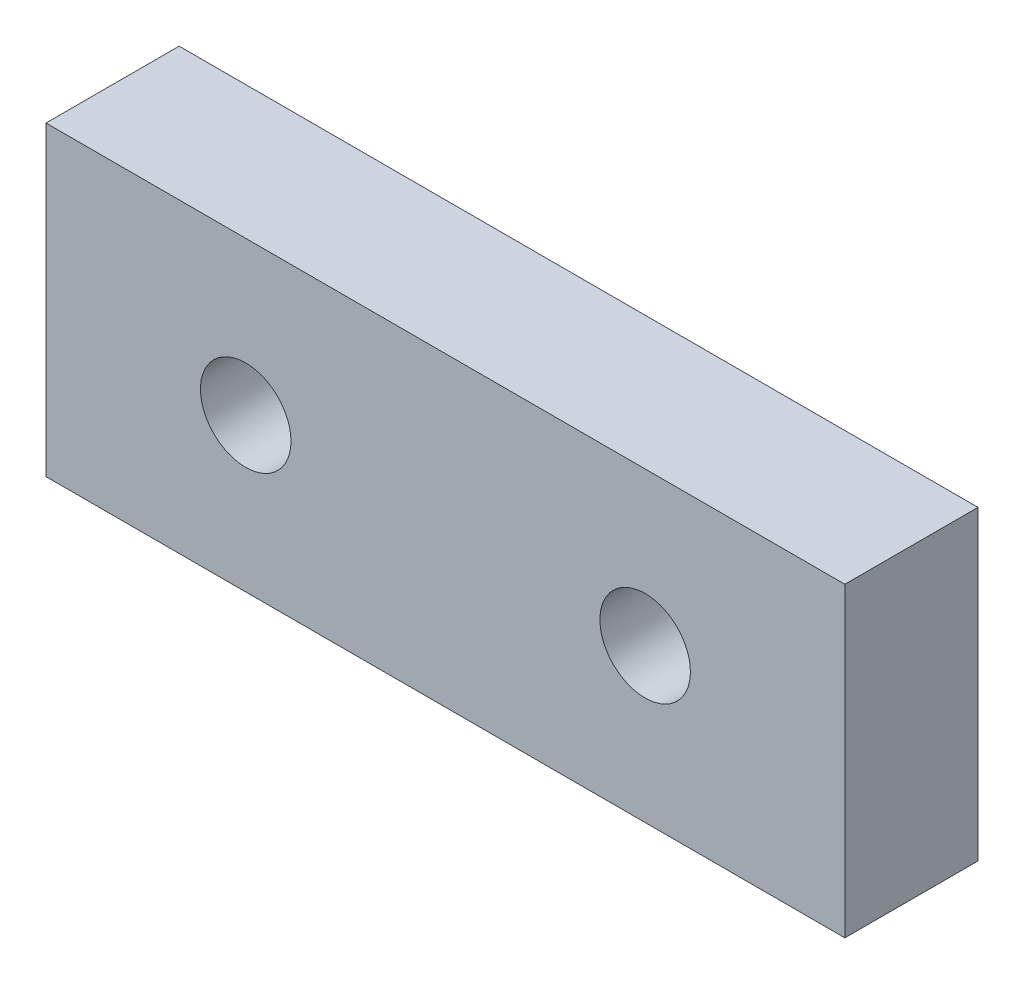
ISO-10303-21;
HEADER;
FILE_DESCRIPTION(('STEP AP214'),'2;1');
FILE_NAME('part.step','',(''),(''),'','','');
FILE_SCHEMA(('AUTOMOTIVE_DESIGN { 1 0 10303 214 1 1 1 1 }'));
ENDSEC;
DATA;
#1=APPLICATION_CONTEXT('core data for automotive mechanical design processes');
#2=APPLICATION_PROTOCOL_DEFINITION('international standard','automotive_design',2000,#1);
#3=PRODUCT_CONTEXT('',#1,'mechanical');
#4=PRODUCT('Part','Part','',(#3));
#5=PRODUCT_RELATED_PRODUCT_CATEGORY('part','',(#4));
#6=PRODUCT_DEFINITION_FORMATION('','',#4);
#7=PRODUCT_DEFINITION_CONTEXT('part definition',#1,'design');
#8=PRODUCT_DEFINITION('design','',#6,#7);
#9=PRODUCT_DEFINITION_SHAPE('','',#8);
#10=(LENGTH_UNIT() NAMED_UNIT(*) SI_UNIT(.MILLI.,.METRE.));
#11=(NAMED_UNIT(*) PLANE_ANGLE_UNIT() SI_UNIT($,.RADIAN.));
#12=(NAMED_UNIT(*) SI_UNIT($,.STERADIAN.) SOLID_ANGLE_UNIT());
#13=UNCERTAINTY_MEASURE_WITH_UNIT(LENGTH_MEASURE(1.E-05),#10,'distance_accuracy_value','');
#14=(GEOMETRIC_REPRESENTATION_CONTEXT(3) GLOBAL_UNCERTAINTY_ASSIGNED_CONTEXT((#13)) GLOBAL_UNIT_ASSIGNED_CONTEXT((#10,
#11,#12)) REPRESENTATION_CONTEXT('',''));
#15=CARTESIAN_POINT('',(0.,0.,0.));
#16=DIRECTION('',(0.,0.,1.));
#17=DIRECTION('',(1.,0.,0.));
#18=AXIS2_PLACEMENT_3D('',#15,#16,#17);
#19=CARTESIAN_POINT('',(15.,5.75,5.));
#20=DIRECTION('',(-1.,0.,0.));
#21=DIRECTION('',(0.,0.,1.));
#22=AXIS2_PLACEMENT_3D('',#19,#20,#21);
#23=PLANE('',#22);
#24=DIRECTION('',(0.,1.,0.));
#25=VECTOR('',#24,1.);
#26=CARTESIAN_POINT('',(15.,5.75,0.));
#27=LINE('',#26,#25);
#28=CARTESIAN_POINT('',(15.,-5.75,0.));
#29=VERTEX_POINT('',#28);
#30=CARTESIAN_POINT('',(15.,5.75,0.));
#31=VERTEX_POINT('',#30);
#32=EDGE_CURVE('E98',#29,#31,#27,.T.);
#33=ORIENTED_EDGE('',*,*,#32,.T.);
#34=DIRECTION('',(0.,0.,-1.));
#35=VECTOR('',#34,1.);
#36=CARTESIAN_POINT('',(15.,5.75,5.));
#37=LINE('',#36,#35);
#38=CARTESIAN_POINT('',(15.,5.75,5.));
#39=VERTEX_POINT('',#38);
#40=EDGE_CURVE('E11',#39,#31,#37,.T.);
#41=ORIENTED_EDGE('',*,*,#40,.F.);
#42=DIRECTION('',(0.,1.,0.));
#43=VECTOR('',#42,1.);
#44=CARTESIAN_POINT('',(15.,5.75,5.));
#45=LINE('',#44,#43);
#46=CARTESIAN_POINT('',(15.,-5.75,5.));
#47=VERTEX_POINT('',#46);
#48=EDGE_CURVE('E86',#47,#39,#45,.T.);
#49=ORIENTED_EDGE('',*,*,#48,.F.);
#50=DIRECTION('',(0.,0.,-1.));
#51=VECTOR('',#50,1.);
#52=CARTESIAN_POINT('',(15.,-5.75,5.));
#53=LINE('',#52,#51);
#54=EDGE_CURVE('E94',#47,#29,#53,.T.);
#55=ORIENTED_EDGE('',*,*,#54,.T.);
#56=EDGE_LOOP('',(#33,#41,#49,#55));
#57=FACE_BOUND('',#56,.T.);
#58=ADVANCED_FACE('F35',(#57),#23,.F.);
#59=CARTESIAN_POINT('',(-15.,5.75,5.));
#60=DIRECTION('',(0.,-1.,0.));
#61=DIRECTION('',(0.,0.,-1.));
#62=AXIS2_PLACEMENT_3D('',#59,#60,#61);
#63=PLANE('',#62);
#64=DIRECTION('',(-1.,0.,0.));
#65=VECTOR('',#64,1.);
#66=CARTESIAN_POINT('',(-15.,5.75,0.));
#67=LINE('',#66,#65);
#68=CARTESIAN_POINT('',(-15.,5.75,0.));
#69=VERTEX_POINT('',#68);
#70=EDGE_CURVE('E90',#31,#69,#67,.T.);
#71=ORIENTED_EDGE('',*,*,#70,.T.);
#72=DIRECTION('',(0.,0.,-1.));
#73=VECTOR('',#72,1.);
#74=CARTESIAN_POINT('',(-15.,5.75,5.));
#75=LINE('',#74,#73);
#76=CARTESIAN_POINT('',(-15.,5.75,5.));
#77=VERTEX_POINT('',#76);
#78=EDGE_CURVE('E43',#77,#69,#75,.T.);
#79=ORIENTED_EDGE('',*,*,#78,.F.);
#80=DIRECTION('',(-1.,0.,0.));
#81=VECTOR('',#80,1.);
#82=CARTESIAN_POINT('',(-15.,5.75,5.));
#83=LINE('',#82,#81);
#84=EDGE_CURVE('E81',#39,#77,#83,.T.);
#85=ORIENTED_EDGE('',*,*,#84,.F.);
#86=ORIENTED_EDGE('',*,*,#40,.T.);
#87=EDGE_LOOP('',(#71,#79,#85,#86));
#88=FACE_BOUND('',#87,.T.);
#89=ADVANCED_FACE('F89',(#88),#63,.F.);
#90=CARTESIAN_POINT('',(-15.,5.75,5.));
#91=DIRECTION('',(1.,0.,0.));
#92=DIRECTION('',(0.,1.,0.));
#93=AXIS2_PLACEMENT_3D('',#90,#91,#92);
#94=PLANE('',#93);
#95=DIRECTION('',(0.,-1.,0.));
#96=VECTOR('',#95,1.);
#97=CARTESIAN_POINT('',(-15.,5.75,0.));
#98=LINE('',#97,#96);
#99=CARTESIAN_POINT('',(-15.,-5.75,0.));
#100=VERTEX_POINT('',#99);
#101=EDGE_CURVE('E68',#69,#100,#98,.T.);
#102=ORIENTED_EDGE('',*,*,#101,.T.);
#103=DIRECTION('',(0.,0.,-1.));
#104=VECTOR('',#103,1.);
#105=CARTESIAN_POINT('',(-15.,-5.75,5.));
#106=LINE('',#105,#104);
#107=CARTESIAN_POINT('',(-15.,-5.75,5.));
#108=VERTEX_POINT('',#107);
#109=EDGE_CURVE('E91',#108,#100,#106,.T.);
#110=ORIENTED_EDGE('',*,*,#109,.F.);
#111=DIRECTION('',(0.,-1.,0.));
#112=VECTOR('',#111,1.);
#113=CARTESIAN_POINT('',(-15.,5.75,5.));
#114=LINE('',#113,#112);
#115=EDGE_CURVE('E84',#77,#108,#114,.T.);
#116=ORIENTED_EDGE('',*,*,#115,.F.);
#117=ORIENTED_EDGE('',*,*,#78,.T.);
#118=EDGE_LOOP('',(#102,#110,#116,#117));
#119=FACE_BOUND('',#118,.T.);
#120=ADVANCED_FACE('F92',(#119),#94,.F.);
#121=CARTESIAN_POINT('',(-15.,-5.75,5.));
#122=DIRECTION('',(0.,1.,0.));
#123=DIRECTION('',(0.,0.,1.));
#124=AXIS2_PLACEMENT_3D('',#121,#122,#123);
#125=PLANE('',#124);
#126=DIRECTION('',(1.,0.,0.));
#127=VECTOR('',#126,1.);
#128=CARTESIAN_POINT('',(-15.,-5.75,0.));
#129=LINE('',#128,#127);
#130=EDGE_CURVE('E74',#100,#29,#129,.T.);
#131=ORIENTED_EDGE('',*,*,#130,.T.);
#132=ORIENTED_EDGE('',*,*,#54,.F.);
#133=DIRECTION('',(1.,0.,0.));
#134=VECTOR('',#133,1.);
#135=CARTESIAN_POINT('',(-15.,-5.75,5.));
#136=LINE('',#135,#134);
#137=EDGE_CURVE('E51',#108,#47,#136,.T.);
#138=ORIENTED_EDGE('',*,*,#137,.F.);
#139=ORIENTED_EDGE('',*,*,#109,.T.);
#140=EDGE_LOOP('',(#131,#132,#138,#139));
#141=FACE_BOUND('',#140,.T.);
#142=ADVANCED_FACE('F106',(#141),#125,.F.);
#143=CARTESIAN_POINT('',(0.,0.,5.));
#144=DIRECTION('',(0.,0.,1.));
#145=DIRECTION('',(1.,0.,0.));
#146=AXIS2_PLACEMENT_3D('',#143,#144,#145);
#147=PLANE('',#146);
#148=CARTESIAN_POINT('',(7.5,0.,5.));
#149=DIRECTION('',(0.,0.,1.));
#150=DIRECTION('',(1.,0.,0.));
#151=AXIS2_PLACEMENT_3D('',#148,#149,#150);
#152=CIRCLE('',#151,1.7);
#153=CARTESIAN_POINT('',(9.2,0.,5.));
#154=VERTEX_POINT('',#153);
#155=EDGE_CURVE('E120',#154,#154,#152,.T.);
#156=ORIENTED_EDGE('',*,*,#155,.F.);
#157=EDGE_LOOP('',(#156));
#158=FACE_BOUND('',#157,.T.);
#159=CARTESIAN_POINT('',(-7.5,0.,5.));
#160=DIRECTION('',(0.,0.,1.));
#161=DIRECTION('',(1.,0.,0.));
#162=AXIS2_PLACEMENT_3D('',#159,#160,#161);
#163=CIRCLE('',#162,1.7);
#164=CARTESIAN_POINT('',(-5.8,0.,5.));
#165=VERTEX_POINT('',#164);
#166=EDGE_CURVE('E114',#165,#165,#163,.T.);
#167=ORIENTED_EDGE('',*,*,#166,.F.);
#168=EDGE_LOOP('',(#167));
#169=FACE_BOUND('',#168,.T.);
#170=ORIENTED_EDGE('',*,*,#48,.T.);
#171=ORIENTED_EDGE('',*,*,#84,.T.);
#172=ORIENTED_EDGE('',*,*,#115,.T.);
#173=ORIENTED_EDGE('',*,*,#137,.T.);
#174=EDGE_LOOP('',(#170,#171,#172,#173));
#175=FACE_BOUND('',#174,.T.);
#176=ADVANCED_FACE('F82',(#158,#169,#175),#147,.T.);
#177=CARTESIAN_POINT('',(0.,0.,0.));
#178=DIRECTION('',(0.,0.,1.));
#179=DIRECTION('',(1.,0.,0.));
#180=AXIS2_PLACEMENT_3D('',#177,#178,#179);
#181=PLANE('',#180);
#182=CARTESIAN_POINT('',(7.5,0.,0.));
#183=DIRECTION('',(0.,0.,1.));
#184=DIRECTION('',(1.,0.,0.));
#185=AXIS2_PLACEMENT_3D('',#182,#183,#184);
#186=CIRCLE('',#185,1.7);
#187=CARTESIAN_POINT('',(9.2,0.,0.));
#188=VERTEX_POINT('',#187);
#189=EDGE_CURVE('E117',#188,#188,#186,.T.);
#190=ORIENTED_EDGE('',*,*,#189,.T.);
#191=EDGE_LOOP('',(#190));
#192=FACE_BOUND('',#191,.T.);
#193=CARTESIAN_POINT('',(-7.5,0.,0.));
#194=DIRECTION('',(0.,0.,1.));
#195=DIRECTION('',(1.,0.,0.));
#196=AXIS2_PLACEMENT_3D('',#193,#194,#195);
#197=CIRCLE('',#196,1.7);
#198=CARTESIAN_POINT('',(-5.8,0.,0.));
#199=VERTEX_POINT('',#198);
#200=EDGE_CURVE('E101',#199,#199,#197,.T.);
#201=ORIENTED_EDGE('',*,*,#200,.T.);
#202=EDGE_LOOP('',(#201));
#203=FACE_BOUND('',#202,.T.);
#204=ORIENTED_EDGE('',*,*,#32,.F.);
#205=ORIENTED_EDGE('',*,*,#130,.F.);
#206=ORIENTED_EDGE('',*,*,#101,.F.);
#207=ORIENTED_EDGE('',*,*,#70,.F.);
#208=EDGE_LOOP('',(#204,#205,#206,#207));
#209=FACE_BOUND('',#208,.T.);
#210=ADVANCED_FACE('F109',(#192,#203,#209),#181,.F.);
#211=CARTESIAN_POINT('',(-7.5,0.,5.));
#212=DIRECTION('',(0.,0.,1.));
#213=DIRECTION('',(1.,0.,0.));
#214=AXIS2_PLACEMENT_3D('',#211,#212,#213);
#215=CYLINDRICAL_SURFACE('',#214,1.7);
#216=ORIENTED_EDGE('',*,*,#200,.F.);
#217=EDGE_LOOP('',(#216));
#218=FACE_BOUND('',#217,.T.);
#219=ORIENTED_EDGE('',*,*,#166,.T.);
#220=EDGE_LOOP('',(#219));
#221=FACE_BOUND('',#220,.T.);
#222=ADVANCED_FACE('F131',(#218,#221),#215,.F.);
#223=CARTESIAN_POINT('',(7.5,0.,5.));
#224=DIRECTION('',(0.,0.,1.));
#225=DIRECTION('',(1.,0.,0.));
#226=AXIS2_PLACEMENT_3D('',#223,#224,#225);
#227=CYLINDRICAL_SURFACE('',#226,1.7);
#228=ORIENTED_EDGE('',*,*,#189,.F.);
#229=EDGE_LOOP('',(#228));
#230=FACE_BOUND('',#229,.T.);
#231=ORIENTED_EDGE('',*,*,#155,.T.);
#232=EDGE_LOOP('',(#231));
#233=FACE_BOUND('',#232,.T.);
#234=ADVANCED_FACE('F124',(#230,#233),#227,.F.);
#235=CLOSED_SHELL('',(#58,#89,#120,#142,#176,#210,#222,#234));
#236=MANIFOLD_SOLID_BREP('B2',#235);
#237=ADVANCED_BREP_SHAPE_REPRESENTATION('',(#18,#236),#14);
#238=SHAPE_DEFINITION_REPRESENTATION(#9,#237);
ENDSEC;
END-ISO-10303-21;
